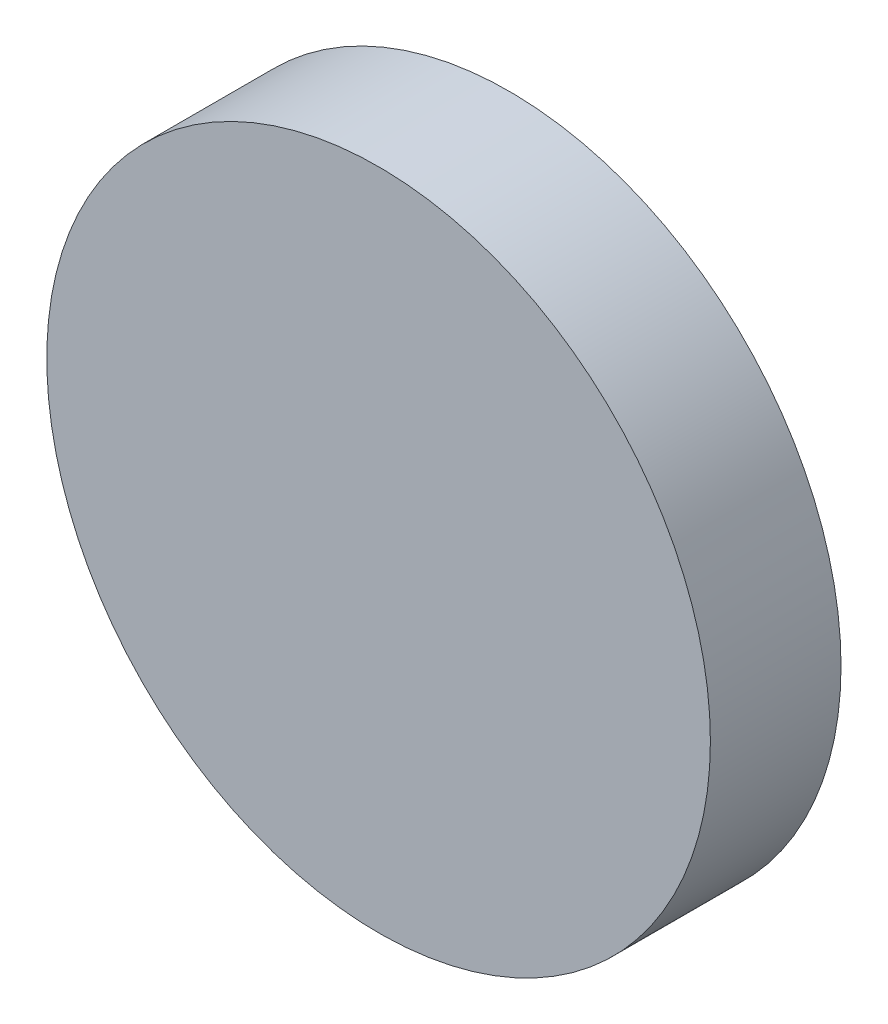
ISO-10303-21;
HEADER;
FILE_DESCRIPTION(('STEP AP214'),'2;1');
FILE_NAME('part.step','',(''),(''),'','','');
FILE_SCHEMA(('AUTOMOTIVE_DESIGN { 1 0 10303 214 1 1 1 1 }'));
ENDSEC;
DATA;
#1=APPLICATION_CONTEXT('core data for automotive mechanical design processes');
#2=APPLICATION_PROTOCOL_DEFINITION('international standard','automotive_design',2000,#1);
#3=PRODUCT_CONTEXT('',#1,'mechanical');
#4=PRODUCT('Part','Part','',(#3));
#5=PRODUCT_RELATED_PRODUCT_CATEGORY('part','',(#4));
#6=PRODUCT_DEFINITION_FORMATION('','',#4);
#7=PRODUCT_DEFINITION_CONTEXT('part definition',#1,'design');
#8=PRODUCT_DEFINITION('design','',#6,#7);
#9=PRODUCT_DEFINITION_SHAPE('','',#8);
#10=(LENGTH_UNIT() NAMED_UNIT(*) SI_UNIT(.MILLI.,.METRE.));
#11=(NAMED_UNIT(*) PLANE_ANGLE_UNIT() SI_UNIT($,.RADIAN.));
#12=(NAMED_UNIT(*) SI_UNIT($,.STERADIAN.) SOLID_ANGLE_UNIT());
#13=UNCERTAINTY_MEASURE_WITH_UNIT(LENGTH_MEASURE(1.E-05),#10,'distance_accuracy_value','');
#14=(GEOMETRIC_REPRESENTATION_CONTEXT(3) GLOBAL_UNCERTAINTY_ASSIGNED_CONTEXT((#13)) GLOBAL_UNIT_ASSIGNED_CONTEXT((#10,
#11,#12)) REPRESENTATION_CONTEXT('',''));
#15=CARTESIAN_POINT('',(0.,0.,0.));
#16=DIRECTION('',(0.,0.,1.));
#17=DIRECTION('',(1.,0.,0.));
#18=AXIS2_PLACEMENT_3D('',#15,#16,#17);
#19=CARTESIAN_POINT('',(0.,0.,5.));
#20=DIRECTION('',(0.,0.,-1.));
#21=DIRECTION('',(-1.,0.,0.));
#22=AXIS2_PLACEMENT_3D('',#19,#20,#21);
#23=CYLINDRICAL_SURFACE('',#22,12.7);
#24=CARTESIAN_POINT('',(0.,0.,5.));
#25=DIRECTION('',(0.,0.,1.));
#26=DIRECTION('',(1.,0.,0.));
#27=AXIS2_PLACEMENT_3D('',#24,#25,#26);
#28=CIRCLE('',#27,12.7);
#29=CARTESIAN_POINT('',(12.7,0.,5.));
#30=VERTEX_POINT('',#29);
#31=EDGE_CURVE('E10',#30,#30,#28,.T.);
#32=ORIENTED_EDGE('',*,*,#31,.F.);
#33=EDGE_LOOP('',(#32));
#34=FACE_BOUND('',#33,.T.);
#35=CARTESIAN_POINT('',(0.,0.,0.));
#36=DIRECTION('',(0.,0.,1.));
#37=DIRECTION('',(1.,0.,0.));
#38=AXIS2_PLACEMENT_3D('',#35,#36,#37);
#39=CIRCLE('',#38,12.7);
#40=CARTESIAN_POINT('',(12.7,0.,0.));
#41=VERTEX_POINT('',#40);
#42=EDGE_CURVE('E38',#41,#41,#39,.T.);
#43=ORIENTED_EDGE('',*,*,#42,.T.);
#44=EDGE_LOOP('',(#43));
#45=FACE_BOUND('',#44,.T.);
#46=ADVANCED_FACE('F35',(#34,#45),#23,.T.);
#47=CARTESIAN_POINT('',(0.,0.,5.));
#48=DIRECTION('',(0.,0.,1.));
#49=DIRECTION('',(1.,0.,0.));
#50=AXIS2_PLACEMENT_3D('',#47,#48,#49);
#51=PLANE('',#50);
#52=ORIENTED_EDGE('',*,*,#31,.T.);
#53=EDGE_LOOP('',(#52));
#54=FACE_BOUND('',#53,.T.);
#55=ADVANCED_FACE('F50',(#54),#51,.T.);
#56=CARTESIAN_POINT('',(0.,0.,0.));
#57=DIRECTION('',(0.,0.,1.));
#58=DIRECTION('',(1.,0.,0.));
#59=AXIS2_PLACEMENT_3D('',#56,#57,#58);
#60=PLANE('',#59);
#61=ORIENTED_EDGE('',*,*,#42,.F.);
#62=EDGE_LOOP('',(#61));
#63=FACE_BOUND('',#62,.T.);
#64=ADVANCED_FACE('F48',(#63),#60,.F.);
#65=CLOSED_SHELL('',(#46,#55,#64));
#66=MANIFOLD_SOLID_BREP('B2',#65);
#67=ADVANCED_BREP_SHAPE_REPRESENTATION('',(#18,#66),#14);
#68=SHAPE_DEFINITION_REPRESENTATION(#9,#67);
ENDSEC;
END-ISO-10303-21;
